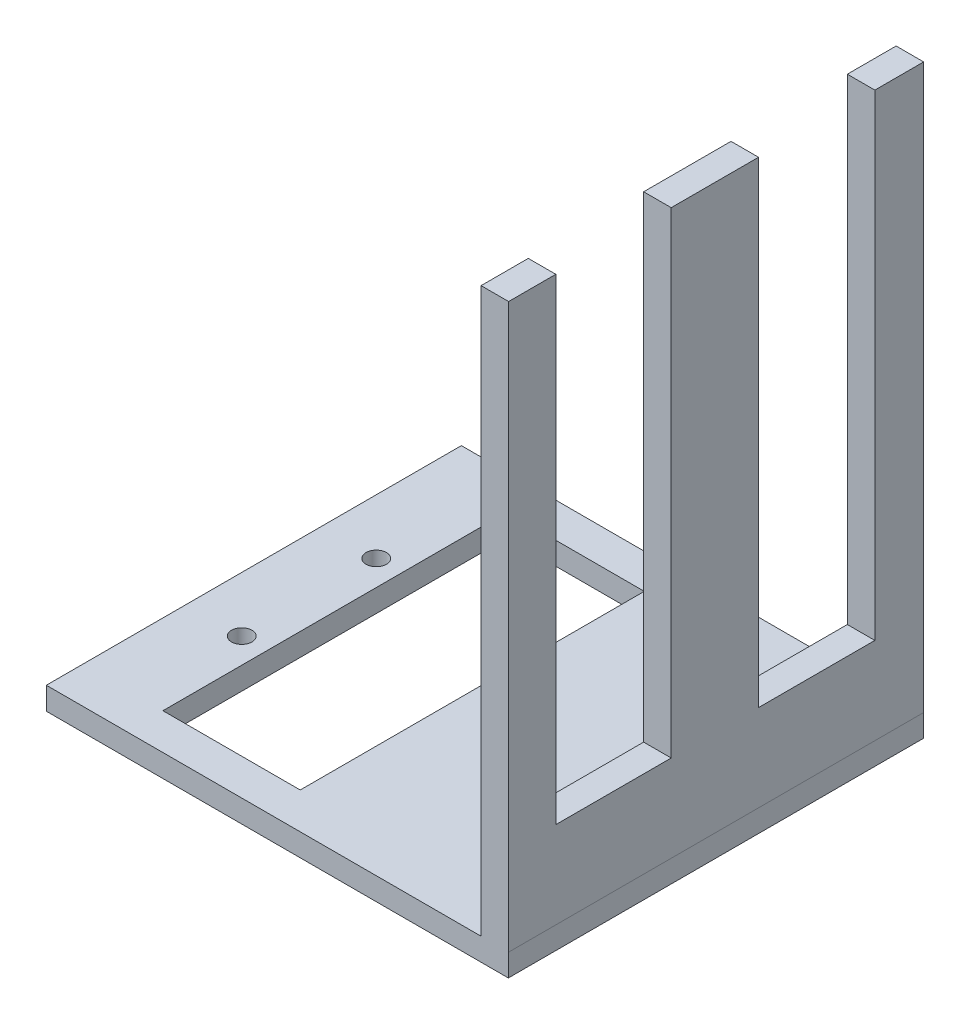
ISO-10303-21;
HEADER;
FILE_DESCRIPTION(('STEP AP214'),'2;1');
FILE_NAME('part.step','',(''),(''),'','','');
FILE_SCHEMA(('AUTOMOTIVE_DESIGN { 1 0 10303 214 1 1 1 1 }'));
ENDSEC;
DATA;
#1=APPLICATION_CONTEXT('core data for automotive mechanical design processes');
#2=APPLICATION_PROTOCOL_DEFINITION('international standard','automotive_design',2000,#1);
#3=PRODUCT_CONTEXT('',#1,'mechanical');
#4=PRODUCT('Part','Part','',(#3));
#5=PRODUCT_RELATED_PRODUCT_CATEGORY('part','',(#4));
#6=PRODUCT_DEFINITION_FORMATION('','',#4);
#7=PRODUCT_DEFINITION_CONTEXT('part definition',#1,'design');
#8=PRODUCT_DEFINITION('design','',#6,#7);
#9=PRODUCT_DEFINITION_SHAPE('','',#8);
#10=(LENGTH_UNIT() NAMED_UNIT(*) SI_UNIT(.MILLI.,.METRE.));
#11=(NAMED_UNIT(*) PLANE_ANGLE_UNIT() SI_UNIT($,.RADIAN.));
#12=(NAMED_UNIT(*) SI_UNIT($,.STERADIAN.) SOLID_ANGLE_UNIT());
#13=UNCERTAINTY_MEASURE_WITH_UNIT(LENGTH_MEASURE(1.E-05),#10,'distance_accuracy_value','');
#14=(GEOMETRIC_REPRESENTATION_CONTEXT(3) GLOBAL_UNCERTAINTY_ASSIGNED_CONTEXT((#13)) GLOBAL_UNIT_ASSIGNED_CONTEXT((#10,
#11,#12)) REPRESENTATION_CONTEXT('',''));
#15=CARTESIAN_POINT('',(0.,0.,0.));
#16=DIRECTION('',(0.,0.,1.));
#17=DIRECTION('',(1.,0.,0.));
#18=AXIS2_PLACEMENT_3D('',#15,#16,#17);
#19=CARTESIAN_POINT('',(0.,104.,0.));
#20=DIRECTION('',(0.,1.,0.));
#21=DIRECTION('',(0.,0.,1.));
#22=AXIS2_PLACEMENT_3D('',#19,#20,#21);
#23=PLANE('',#22);
#24=DIRECTION('',(-1.,0.,0.));
#25=VECTOR('',#24,1.);
#26=CARTESIAN_POINT('',(0.,104.,10.1357515163727));
#27=LINE('',#26,#25);
#28=CARTESIAN_POINT('',(41.7155006134067,104.,10.1357515163727));
#29=VERTEX_POINT('',#28);
#30=CARTESIAN_POINT('',(36.8283216627106,104.,10.1357515163727));
#31=VERTEX_POINT('',#30);
#32=EDGE_CURVE('E11',#29,#31,#27,.T.);
#33=ORIENTED_EDGE('',*,*,#32,.F.);
#34=DIRECTION('',(0.,0.,-1.));
#35=VECTOR('',#34,1.);
#36=CARTESIAN_POINT('',(41.7155006134067,104.,-34.672058238389));
#37=LINE('',#36,#35);
#38=CARTESIAN_POINT('',(41.7155006134067,104.,-5.36606988117683));
#39=VERTEX_POINT('',#38);
#40=EDGE_CURVE('E259',#29,#39,#37,.T.);
#41=ORIENTED_EDGE('',*,*,#40,.T.);
#42=DIRECTION('',(1.,0.,0.));
#43=VECTOR('',#42,1.);
#44=CARTESIAN_POINT('',(0.,104.,-5.36606988117683));
#45=LINE('',#44,#43);
#46=CARTESIAN_POINT('',(36.8283216627106,104.,-5.36606988117683));
#47=VERTEX_POINT('',#46);
#48=EDGE_CURVE('E330',#47,#39,#45,.T.);
#49=ORIENTED_EDGE('',*,*,#48,.F.);
#50=DIRECTION('',(0.,0.,1.));
#51=VECTOR('',#50,1.);
#52=CARTESIAN_POINT('',(36.8283216627106,104.,-34.672058238389));
#53=LINE('',#52,#51);
#54=EDGE_CURVE('E252',#47,#31,#53,.T.);
#55=ORIENTED_EDGE('',*,*,#54,.T.);
#56=EDGE_LOOP('',(#33,#41,#49,#55));
#57=FACE_BOUND('',#56,.T.);
#58=ADVANCED_FACE('F33',(#57),#23,.T.);
#59=DIRECTION('',(-1.,0.,0.));
#60=VECTOR('',#59,1.);
#61=CARTESIAN_POINT('',(0.,104.,-26.0087154571806));
#62=LINE('',#61,#60);
#63=CARTESIAN_POINT('',(41.7155006134067,104.,-26.0087154571806));
#64=VERTEX_POINT('',#63);
#65=CARTESIAN_POINT('',(36.8283216627106,104.,-26.0087154571806));
#66=VERTEX_POINT('',#65);
#67=EDGE_CURVE('E332',#64,#66,#62,.T.);
#68=ORIENTED_EDGE('',*,*,#67,.F.);
#69=CARTESIAN_POINT('',(41.7155006134067,104.,-34.672058238389));
#70=VERTEX_POINT('',#69);
#71=EDGE_CURVE('E255',#64,#70,#37,.T.);
#72=ORIENTED_EDGE('',*,*,#71,.T.);
#73=DIRECTION('',(-1.,0.,0.));
#74=VECTOR('',#73,1.);
#75=CARTESIAN_POINT('',(36.8283216627106,104.,-34.672058238389));
#76=LINE('',#75,#74);
#77=CARTESIAN_POINT('',(36.8283216627106,104.,-34.672058238389));
#78=VERTEX_POINT('',#77);
#79=EDGE_CURVE('E258',#70,#78,#76,.T.);
#80=ORIENTED_EDGE('',*,*,#79,.T.);
#81=EDGE_CURVE('E248',#78,#66,#53,.T.);
#82=ORIENTED_EDGE('',*,*,#81,.T.);
#83=EDGE_LOOP('',(#68,#72,#80,#82));
#84=FACE_BOUND('',#83,.T.);
#85=ADVANCED_FACE('F343',(#84),#23,.T.);
#86=CARTESIAN_POINT('',(-40.3323535464941,4.,-34.672058238389));
#87=DIRECTION('',(1.,0.,0.));
#88=DIRECTION('',(0.,0.,-1.));
#89=AXIS2_PLACEMENT_3D('',#86,#87,#88);
#90=PLANE('',#89);
#91=DIRECTION('',(0.,0.,1.));
#92=VECTOR('',#91,1.);
#93=CARTESIAN_POINT('',(-40.3323535464941,0.,-34.672058238389));
#94=LINE('',#93,#92);
#95=CARTESIAN_POINT('',(-40.3323535464941,0.,-34.672058238389));
#96=VERTEX_POINT('',#95);
#97=CARTESIAN_POINT('',(-40.3323535464941,0.,38.987941761611));
#98=VERTEX_POINT('',#97);
#99=EDGE_CURVE('E283',#96,#98,#94,.T.);
#100=ORIENTED_EDGE('',*,*,#99,.T.);
#101=DIRECTION('',(0.,-1.,0.));
#102=VECTOR('',#101,1.);
#103=CARTESIAN_POINT('',(-40.3323535464941,4.,38.987941761611));
#104=LINE('',#103,#102);
#105=CARTESIAN_POINT('',(-40.3323535464941,4.,38.987941761611));
#106=VERTEX_POINT('',#105);
#107=EDGE_CURVE('E311',#106,#98,#104,.T.);
#108=ORIENTED_EDGE('',*,*,#107,.F.);
#109=DIRECTION('',(0.,0.,1.));
#110=VECTOR('',#109,1.);
#111=CARTESIAN_POINT('',(-40.3323535464941,4.,-34.672058238389));
#112=LINE('',#111,#110);
#113=CARTESIAN_POINT('',(-40.3323535464941,4.,-34.672058238389));
#114=VERTEX_POINT('',#113);
#115=EDGE_CURVE('E284',#114,#106,#112,.T.);
#116=ORIENTED_EDGE('',*,*,#115,.F.);
#117=DIRECTION('',(0.,-1.,0.));
#118=VECTOR('',#117,1.);
#119=CARTESIAN_POINT('',(-40.3323535464941,4.,-34.672058238389));
#120=LINE('',#119,#118);
#121=EDGE_CURVE('E295',#114,#96,#120,.T.);
#122=ORIENTED_EDGE('',*,*,#121,.T.);
#123=EDGE_LOOP('',(#100,#108,#116,#122));
#124=FACE_BOUND('',#123,.T.);
#125=ADVANCED_FACE('F35',(#124),#90,.F.);
#126=CARTESIAN_POINT('',(-40.3323535464941,4.,38.987941761611));
#127=DIRECTION('',(0.,0.,-1.));
#128=DIRECTION('',(-1.,0.,0.));
#129=AXIS2_PLACEMENT_3D('',#126,#127,#128);
#130=PLANE('',#129);
#131=DIRECTION('',(1.,0.,0.));
#132=VECTOR('',#131,1.);
#133=CARTESIAN_POINT('',(-40.3323535464941,0.,38.987941761611));
#134=LINE('',#133,#132);
#135=CARTESIAN_POINT('',(41.6676464535059,0.,38.987941761611));
#136=VERTEX_POINT('',#135);
#137=EDGE_CURVE('E298',#98,#136,#134,.T.);
#138=ORIENTED_EDGE('',*,*,#137,.T.);
#139=DIRECTION('',(0.,-1.,0.));
#140=VECTOR('',#139,1.);
#141=CARTESIAN_POINT('',(41.6676464535059,4.,38.987941761611));
#142=LINE('',#141,#140);
#143=CARTESIAN_POINT('',(41.6676464535059,4.,38.987941761611));
#144=VERTEX_POINT('',#143);
#145=EDGE_CURVE('E308',#144,#136,#142,.T.);
#146=ORIENTED_EDGE('',*,*,#145,.F.);
#147=DIRECTION('',(1.,0.,0.));
#148=VECTOR('',#147,1.);
#149=CARTESIAN_POINT('',(36.8283216627106,4.,38.987941761611));
#150=LINE('',#149,#148);
#151=CARTESIAN_POINT('',(41.7155006134067,4.,38.987941761611));
#152=VERTEX_POINT('',#151);
#153=EDGE_CURVE('E265',#144,#152,#150,.T.);
#154=ORIENTED_EDGE('',*,*,#153,.T.);
#155=DIRECTION('',(0.,-1.,0.));
#156=VECTOR('',#155,1.);
#157=CARTESIAN_POINT('',(41.7155006134067,104.,38.987941761611));
#158=LINE('',#157,#156);
#159=CARTESIAN_POINT('',(41.7155006134067,104.,38.987941761611));
#160=VERTEX_POINT('',#159);
#161=EDGE_CURVE('E277',#160,#152,#158,.T.);
#162=ORIENTED_EDGE('',*,*,#161,.F.);
#163=DIRECTION('',(1.,0.,0.));
#164=VECTOR('',#163,1.);
#165=CARTESIAN_POINT('',(36.8283216627106,104.,38.987941761611));
#166=LINE('',#165,#164);
#167=CARTESIAN_POINT('',(36.8283216627106,104.,38.987941761611));
#168=VERTEX_POINT('',#167);
#169=EDGE_CURVE('E251',#168,#160,#166,.T.);
#170=ORIENTED_EDGE('',*,*,#169,.F.);
#171=DIRECTION('',(0.,-1.,0.));
#172=VECTOR('',#171,1.);
#173=CARTESIAN_POINT('',(36.8283216627106,104.,38.987941761611));
#174=LINE('',#173,#172);
#175=CARTESIAN_POINT('',(36.8283216627106,4.,38.987941761611));
#176=VERTEX_POINT('',#175);
#177=EDGE_CURVE('E280',#168,#176,#174,.T.);
#178=ORIENTED_EDGE('',*,*,#177,.T.);
#179=DIRECTION('',(1.,0.,0.));
#180=VECTOR('',#179,1.);
#181=CARTESIAN_POINT('',(-40.3323535464941,4.,38.987941761611));
#182=LINE('',#181,#180);
#183=EDGE_CURVE('E287',#106,#176,#182,.T.);
#184=ORIENTED_EDGE('',*,*,#183,.F.);
#185=ORIENTED_EDGE('',*,*,#107,.T.);
#186=EDGE_LOOP('',(#138,#146,#154,#162,#170,#178,#184,#185));
#187=FACE_BOUND('',#186,.T.);
#188=ADVANCED_FACE('F359',(#187),#130,.F.);
#189=CARTESIAN_POINT('',(41.6676464535059,4.,-34.672058238389));
#190=DIRECTION('',(-1.,0.,0.));
#191=DIRECTION('',(0.,0.,1.));
#192=AXIS2_PLACEMENT_3D('',#189,#190,#191);
#193=PLANE('',#192);
#194=DIRECTION('',(0.,0.,-1.));
#195=VECTOR('',#194,1.);
#196=CARTESIAN_POINT('',(41.6676464535059,0.,-34.672058238389));
#197=LINE('',#196,#195);
#198=CARTESIAN_POINT('',(41.6676464535059,0.,-34.672058238389));
#199=VERTEX_POINT('',#198);
#200=EDGE_CURVE('E300',#136,#199,#197,.T.);
#201=ORIENTED_EDGE('',*,*,#200,.T.);
#202=DIRECTION('',(0.,-1.,0.));
#203=VECTOR('',#202,1.);
#204=CARTESIAN_POINT('',(41.6676464535059,4.,-34.672058238389));
#205=LINE('',#204,#203);
#206=CARTESIAN_POINT('',(41.6676464535059,4.,-34.672058238389));
#207=VERTEX_POINT('',#206);
#208=EDGE_CURVE('E305',#207,#199,#205,.T.);
#209=ORIENTED_EDGE('',*,*,#208,.F.);
#210=DIRECTION('',(0.,0.,-1.));
#211=VECTOR('',#210,1.);
#212=CARTESIAN_POINT('',(41.6676464535059,4.,-34.672058238389));
#213=LINE('',#212,#211);
#214=EDGE_CURVE('E290',#144,#207,#213,.T.);
#215=ORIENTED_EDGE('',*,*,#214,.F.);
#216=ORIENTED_EDGE('',*,*,#145,.T.);
#217=EDGE_LOOP('',(#201,#209,#215,#216));
#218=FACE_BOUND('',#217,.T.);
#219=ADVANCED_FACE('F410',(#218),#193,.F.);
#220=CARTESIAN_POINT('',(-40.3323535464941,4.,-34.672058238389));
#221=DIRECTION('',(0.,0.,1.));
#222=DIRECTION('',(1.,0.,0.));
#223=AXIS2_PLACEMENT_3D('',#220,#221,#222);
#224=PLANE('',#223);
#225=DIRECTION('',(-1.,0.,0.));
#226=VECTOR('',#225,1.);
#227=CARTESIAN_POINT('',(-40.3323535464941,0.,-34.672058238389));
#228=LINE('',#227,#226);
#229=EDGE_CURVE('E288',#199,#96,#228,.T.);
#230=ORIENTED_EDGE('',*,*,#229,.T.);
#231=ORIENTED_EDGE('',*,*,#121,.F.);
#232=DIRECTION('',(-1.,0.,0.));
#233=VECTOR('',#232,1.);
#234=CARTESIAN_POINT('',(-40.3323535464941,4.,-34.672058238389));
#235=LINE('',#234,#233);
#236=CARTESIAN_POINT('',(36.8283216627106,4.,-34.672058238389));
#237=VERTEX_POINT('',#236);
#238=EDGE_CURVE('E293',#237,#114,#235,.T.);
#239=ORIENTED_EDGE('',*,*,#238,.F.);
#240=DIRECTION('',(0.,-1.,0.));
#241=VECTOR('',#240,1.);
#242=CARTESIAN_POINT('',(36.8283216627106,104.,-34.672058238389));
#243=LINE('',#242,#241);
#244=EDGE_CURVE('E261',#78,#237,#243,.T.);
#245=ORIENTED_EDGE('',*,*,#244,.F.);
#246=ORIENTED_EDGE('',*,*,#79,.F.);
#247=DIRECTION('',(0.,-1.,0.));
#248=VECTOR('',#247,1.);
#249=CARTESIAN_POINT('',(41.7155006134067,104.,-34.672058238389));
#250=LINE('',#249,#248);
#251=CARTESIAN_POINT('',(41.7155006134067,4.,-34.672058238389));
#252=VERTEX_POINT('',#251);
#253=EDGE_CURVE('E274',#70,#252,#250,.T.);
#254=ORIENTED_EDGE('',*,*,#253,.T.);
#255=DIRECTION('',(-1.,0.,0.));
#256=VECTOR('',#255,1.);
#257=CARTESIAN_POINT('',(36.8283216627106,4.,-34.672058238389));
#258=LINE('',#257,#256);
#259=EDGE_CURVE('E269',#252,#207,#258,.T.);
#260=ORIENTED_EDGE('',*,*,#259,.T.);
#261=ORIENTED_EDGE('',*,*,#208,.T.);
#262=EDGE_LOOP('',(#230,#231,#239,#245,#246,#254,#260,#261));
#263=FACE_BOUND('',#262,.T.);
#264=ADVANCED_FACE('F349',(#263),#224,.F.);
#265=CARTESIAN_POINT('',(0.,4.,0.));
#266=DIRECTION('',(0.,1.,0.));
#267=DIRECTION('',(0.,0.,1.));
#268=AXIS2_PLACEMENT_3D('',#265,#266,#267);
#269=PLANE('',#268);
#270=DIRECTION('',(0.,0.,-1.));
#271=VECTOR('',#270,1.);
#272=CARTESIAN_POINT('',(-1.70011262750802,4.,-28.5027211675137));
#273=LINE('',#272,#271);
#274=CARTESIAN_POINT('',(-1.70011262750802,4.,32.5599938993808));
#275=VERTEX_POINT('',#274);
#276=CARTESIAN_POINT('',(-1.70011262750802,4.,-28.5027211675137));
#277=VERTEX_POINT('',#276);
#278=EDGE_CURVE('E220',#275,#277,#273,.T.);
#279=ORIENTED_EDGE('',*,*,#278,.F.);
#280=DIRECTION('',(1.,0.,0.));
#281=VECTOR('',#280,1.);
#282=CARTESIAN_POINT('',(-1.70011262750802,4.,32.5599938993808));
#283=LINE('',#282,#281);
#284=CARTESIAN_POINT('',(-26.070112627508,4.,32.5599938993808));
#285=VERTEX_POINT('',#284);
#286=EDGE_CURVE('E228',#285,#275,#283,.T.);
#287=ORIENTED_EDGE('',*,*,#286,.F.);
#288=DIRECTION('',(0.,0.,1.));
#289=VECTOR('',#288,1.);
#290=CARTESIAN_POINT('',(-26.070112627508,4.,-28.5027211675137));
#291=LINE('',#290,#289);
#292=CARTESIAN_POINT('',(-26.070112627508,4.,-28.5027211675137));
#293=VERTEX_POINT('',#292);
#294=EDGE_CURVE('E225',#293,#285,#291,.T.);
#295=ORIENTED_EDGE('',*,*,#294,.F.);
#296=DIRECTION('',(-1.,0.,0.));
#297=VECTOR('',#296,1.);
#298=CARTESIAN_POINT('',(-1.70011262750802,4.,-28.5027211675137));
#299=LINE('',#298,#297);
#300=EDGE_CURVE('E222',#277,#293,#299,.T.);
#301=ORIENTED_EDGE('',*,*,#300,.F.);
#302=EDGE_LOOP('',(#279,#287,#295,#301));
#303=FACE_BOUND('',#302,.T.);
#304=CARTESIAN_POINT('',(-30.5440501475938,4.,14.097941761611));
#305=DIRECTION('',(0.,1.,0.));
#306=DIRECTION('',(0.,0.,1.));
#307=AXIS2_PLACEMENT_3D('',#304,#305,#306);
#308=CIRCLE('',#307,1.8125);
#309=CARTESIAN_POINT('',(-30.5440501475938,4.,15.910441761611));
#310=VERTEX_POINT('',#309);
#311=EDGE_CURVE('E234',#310,#310,#308,.T.);
#312=ORIENTED_EDGE('',*,*,#311,.F.);
#313=EDGE_LOOP('',(#312));
#314=FACE_BOUND('',#313,.T.);
#315=CARTESIAN_POINT('',(-30.5440501475938,4.,-9.782058238389));
#316=DIRECTION('',(0.,1.,0.));
#317=DIRECTION('',(0.,0.,1.));
#318=AXIS2_PLACEMENT_3D('',#315,#316,#317);
#319=CIRCLE('',#318,1.8125);
#320=CARTESIAN_POINT('',(-30.5440501475938,4.,-7.969558238389));
#321=VERTEX_POINT('',#320);
#322=EDGE_CURVE('E244',#321,#321,#319,.T.);
#323=ORIENTED_EDGE('',*,*,#322,.F.);
#324=EDGE_LOOP('',(#323));
#325=FACE_BOUND('',#324,.T.);
#326=DIRECTION('',(0.,0.,1.));
#327=VECTOR('',#326,1.);
#328=CARTESIAN_POINT('',(36.8283216627106,4.,-34.672058238389));
#329=LINE('',#328,#327);
#330=EDGE_CURVE('E262',#237,#176,#329,.T.);
#331=ORIENTED_EDGE('',*,*,#330,.F.);
#332=ORIENTED_EDGE('',*,*,#238,.T.);
#333=ORIENTED_EDGE('',*,*,#115,.T.);
#334=ORIENTED_EDGE('',*,*,#183,.T.);
#335=EDGE_LOOP('',(#331,#332,#333,#334));
#336=FACE_BOUND('',#335,.T.);
#337=ADVANCED_FACE('F354',(#303,#314,#325,#336),#269,.T.);
#338=CARTESIAN_POINT('',(0.,0.,0.));
#339=DIRECTION('',(0.,1.,0.));
#340=DIRECTION('',(0.,0.,1.));
#341=AXIS2_PLACEMENT_3D('',#338,#339,#340);
#342=PLANE('',#341);
#343=DIRECTION('',(1.,0.,0.));
#344=VECTOR('',#343,1.);
#345=CARTESIAN_POINT('',(0.,0.,32.5599938993808));
#346=LINE('',#345,#344);
#347=CARTESIAN_POINT('',(-26.070112627508,0.,32.5599938993808));
#348=VERTEX_POINT('',#347);
#349=CARTESIAN_POINT('',(-1.70011262750802,0.,32.5599938993808));
#350=VERTEX_POINT('',#349);
#351=EDGE_CURVE('E324',#348,#350,#346,.T.);
#352=ORIENTED_EDGE('',*,*,#351,.T.);
#353=DIRECTION('',(0.,0.,-1.));
#354=VECTOR('',#353,1.);
#355=CARTESIAN_POINT('',(-1.70011262750802,0.,0.));
#356=LINE('',#355,#354);
#357=CARTESIAN_POINT('',(-1.70011262750802,0.,-28.5027211675137));
#358=VERTEX_POINT('',#357);
#359=EDGE_CURVE('E327',#350,#358,#356,.T.);
#360=ORIENTED_EDGE('',*,*,#359,.T.);
#361=DIRECTION('',(-1.,0.,0.));
#362=VECTOR('',#361,1.);
#363=CARTESIAN_POINT('',(0.,0.,-28.5027211675137));
#364=LINE('',#363,#362);
#365=CARTESIAN_POINT('',(-26.070112627508,0.,-28.5027211675137));
#366=VERTEX_POINT('',#365);
#367=EDGE_CURVE('E314',#358,#366,#364,.T.);
#368=ORIENTED_EDGE('',*,*,#367,.T.);
#369=DIRECTION('',(0.,0.,1.));
#370=VECTOR('',#369,1.);
#371=CARTESIAN_POINT('',(-26.070112627508,0.,0.));
#372=LINE('',#371,#370);
#373=EDGE_CURVE('E321',#366,#348,#372,.T.);
#374=ORIENTED_EDGE('',*,*,#373,.T.);
#375=EDGE_LOOP('',(#352,#360,#368,#374));
#376=FACE_BOUND('',#375,.T.);
#377=CARTESIAN_POINT('',(-30.5440501475938,0.,14.097941761611));
#378=DIRECTION('',(0.,1.,0.));
#379=DIRECTION('',(0.,0.,1.));
#380=AXIS2_PLACEMENT_3D('',#377,#378,#379);
#381=CIRCLE('',#380,1.8125);
#382=CARTESIAN_POINT('',(-30.5440501475938,0.,15.910441761611));
#383=VERTEX_POINT('',#382);
#384=EDGE_CURVE('E243',#383,#383,#381,.T.);
#385=ORIENTED_EDGE('',*,*,#384,.T.);
#386=EDGE_LOOP('',(#385));
#387=FACE_BOUND('',#386,.T.);
#388=CARTESIAN_POINT('',(-30.5440501475938,0.,-9.782058238389));
#389=DIRECTION('',(0.,1.,0.));
#390=DIRECTION('',(0.,0.,1.));
#391=AXIS2_PLACEMENT_3D('',#388,#389,#390);
#392=CIRCLE('',#391,1.8125);
#393=CARTESIAN_POINT('',(-30.5440501475938,0.,-7.969558238389));
#394=VERTEX_POINT('',#393);
#395=EDGE_CURVE('E247',#394,#394,#392,.T.);
#396=ORIENTED_EDGE('',*,*,#395,.T.);
#397=EDGE_LOOP('',(#396));
#398=FACE_BOUND('',#397,.T.);
#399=ORIENTED_EDGE('',*,*,#99,.F.);
#400=ORIENTED_EDGE('',*,*,#229,.F.);
#401=ORIENTED_EDGE('',*,*,#200,.F.);
#402=ORIENTED_EDGE('',*,*,#137,.F.);
#403=EDGE_LOOP('',(#399,#400,#401,#402));
#404=FACE_BOUND('',#403,.T.);
#405=ADVANCED_FACE('F403',(#376,#387,#398,#404),#342,.F.);
#406=CARTESIAN_POINT('',(0.,4.,0.));
#407=DIRECTION('',(0.,1.,0.));
#408=DIRECTION('',(0.,0.,1.));
#409=AXIS2_PLACEMENT_3D('',#406,#407,#408);
#410=PLANE('',#409);
#411=ORIENTED_EDGE('',*,*,#153,.F.);
#412=ORIENTED_EDGE('',*,*,#214,.T.);
#413=ORIENTED_EDGE('',*,*,#259,.F.);
#414=DIRECTION('',(0.,0.,-1.));
#415=VECTOR('',#414,1.);
#416=CARTESIAN_POINT('',(41.7155006134067,4.,-34.672058238389));
#417=LINE('',#416,#415);
#418=EDGE_CURVE('E267',#152,#252,#417,.T.);
#419=ORIENTED_EDGE('',*,*,#418,.F.);
#420=EDGE_LOOP('',(#411,#412,#413,#419));
#421=FACE_BOUND('',#420,.T.);
#422=ADVANCED_FACE('F398',(#421),#410,.F.);
#423=CARTESIAN_POINT('',(36.8283216627106,104.,-34.672058238389));
#424=DIRECTION('',(1.,0.,0.));
#425=DIRECTION('',(0.,0.,-1.));
#426=AXIS2_PLACEMENT_3D('',#423,#424,#425);
#427=PLANE('',#426);
#428=DIRECTION('',(0.,0.,-1.));
#429=VECTOR('',#428,1.);
#430=CARTESIAN_POINT('',(36.8283216627106,19.4116628171059,-34.672058238389));
#431=LINE('',#430,#429);
#432=CARTESIAN_POINT('',(36.8283216627106,19.4116628171059,30.6149391770418));
#433=VERTEX_POINT('',#432);
#434=CARTESIAN_POINT('',(36.8283216627106,19.4116628171059,10.1357515163727));
#435=VERTEX_POINT('',#434);
#436=EDGE_CURVE('E179',#433,#435,#431,.T.);
#437=ORIENTED_EDGE('',*,*,#436,.T.);
#438=DIRECTION('',(0.,1.,0.));
#439=VECTOR('',#438,1.);
#440=CARTESIAN_POINT('',(36.8283216627106,104.,10.1357515163727));
#441=LINE('',#440,#439);
#442=EDGE_CURVE('E197',#435,#31,#441,.T.);
#443=ORIENTED_EDGE('',*,*,#442,.T.);
#444=ORIENTED_EDGE('',*,*,#54,.F.);
#445=DIRECTION('',(0.,-1.,0.));
#446=VECTOR('',#445,1.);
#447=CARTESIAN_POINT('',(36.8283216627106,104.,-5.36606988117683));
#448=LINE('',#447,#446);
#449=CARTESIAN_POINT('',(36.8283216627106,19.4116628171059,-5.36606988117683));
#450=VERTEX_POINT('',#449);
#451=EDGE_CURVE('E56',#47,#450,#448,.T.);
#452=ORIENTED_EDGE('',*,*,#451,.T.);
#453=DIRECTION('',(0.,0.,-1.));
#454=VECTOR('',#453,1.);
#455=CARTESIAN_POINT('',(36.8283216627106,19.4116628171059,-34.672058238389));
#456=LINE('',#455,#454);
#457=CARTESIAN_POINT('',(36.8283216627106,19.4116628171059,-26.0087154571806));
#458=VERTEX_POINT('',#457);
#459=EDGE_CURVE('E217',#450,#458,#456,.T.);
#460=ORIENTED_EDGE('',*,*,#459,.T.);
#461=DIRECTION('',(0.,1.,0.));
#462=VECTOR('',#461,1.);
#463=CARTESIAN_POINT('',(36.8283216627106,104.,-26.0087154571806));
#464=LINE('',#463,#462);
#465=EDGE_CURVE('E214',#458,#66,#464,.T.);
#466=ORIENTED_EDGE('',*,*,#465,.T.);
#467=ORIENTED_EDGE('',*,*,#81,.F.);
#468=ORIENTED_EDGE('',*,*,#244,.T.);
#469=ORIENTED_EDGE('',*,*,#330,.T.);
#470=ORIENTED_EDGE('',*,*,#177,.F.);
#471=CARTESIAN_POINT('',(36.8283216627106,104.,30.6149391770418));
#472=VERTEX_POINT('',#471);
#473=EDGE_CURVE('E253',#472,#168,#53,.T.);
#474=ORIENTED_EDGE('',*,*,#473,.F.);
#475=DIRECTION('',(0.,-1.,0.));
#476=VECTOR('',#475,1.);
#477=CARTESIAN_POINT('',(36.8283216627106,104.,30.6149391770418));
#478=LINE('',#477,#476);
#479=EDGE_CURVE('E48',#472,#433,#478,.T.);
#480=ORIENTED_EDGE('',*,*,#479,.T.);
#481=EDGE_LOOP('',(#437,#443,#444,#452,#460,#466,#467,#468,#469,#470,#474,#480));
#482=FACE_BOUND('',#481,.T.);
#483=ADVANCED_FACE('F342',(#482),#427,.F.);
#484=CARTESIAN_POINT('',(41.7155006134067,104.,-34.672058238389));
#485=DIRECTION('',(-1.,0.,0.));
#486=DIRECTION('',(0.,0.,1.));
#487=AXIS2_PLACEMENT_3D('',#484,#485,#486);
#488=PLANE('',#487);
#489=ORIENTED_EDGE('',*,*,#40,.F.);
#490=DIRECTION('',(0.,1.,0.));
#491=VECTOR('',#490,1.);
#492=CARTESIAN_POINT('',(41.7155006134067,19.4116628171059,10.1357515163727));
#493=LINE('',#492,#491);
#494=CARTESIAN_POINT('',(41.7155006134067,19.4116628171059,10.1357515163727));
#495=VERTEX_POINT('',#494);
#496=EDGE_CURVE('E188',#495,#29,#493,.T.);
#497=ORIENTED_EDGE('',*,*,#496,.F.);
#498=DIRECTION('',(0.,0.,-1.));
#499=VECTOR('',#498,1.);
#500=CARTESIAN_POINT('',(41.7155006134067,19.4116628171059,10.1357515163727));
#501=LINE('',#500,#499);
#502=CARTESIAN_POINT('',(41.7155006134067,19.4116628171059,30.6149391770418));
#503=VERTEX_POINT('',#502);
#504=EDGE_CURVE('E176',#503,#495,#501,.T.);
#505=ORIENTED_EDGE('',*,*,#504,.F.);
#506=DIRECTION('',(0.,-1.,0.));
#507=VECTOR('',#506,1.);
#508=CARTESIAN_POINT('',(41.7155006134067,19.4116628171059,30.6149391770418));
#509=LINE('',#508,#507);
#510=CARTESIAN_POINT('',(41.7155006134067,104.,30.6149391770418));
#511=VERTEX_POINT('',#510);
#512=EDGE_CURVE('E183',#511,#503,#509,.T.);
#513=ORIENTED_EDGE('',*,*,#512,.F.);
#514=EDGE_CURVE('E256',#160,#511,#37,.T.);
#515=ORIENTED_EDGE('',*,*,#514,.F.);
#516=ORIENTED_EDGE('',*,*,#161,.T.);
#517=ORIENTED_EDGE('',*,*,#418,.T.);
#518=ORIENTED_EDGE('',*,*,#253,.F.);
#519=ORIENTED_EDGE('',*,*,#71,.F.);
#520=DIRECTION('',(0.,1.,0.));
#521=VECTOR('',#520,1.);
#522=CARTESIAN_POINT('',(41.7155006134067,19.4116628171059,-26.0087154571806));
#523=LINE('',#522,#521);
#524=CARTESIAN_POINT('',(41.7155006134067,19.4116628171059,-26.0087154571806));
#525=VERTEX_POINT('',#524);
#526=EDGE_CURVE('E201',#525,#64,#523,.T.);
#527=ORIENTED_EDGE('',*,*,#526,.F.);
#528=DIRECTION('',(0.,0.,-1.));
#529=VECTOR('',#528,1.);
#530=CARTESIAN_POINT('',(41.7155006134067,19.4116628171059,-26.0087154571806));
#531=LINE('',#530,#529);
#532=CARTESIAN_POINT('',(41.7155006134067,19.4116628171059,-5.36606988117683));
#533=VERTEX_POINT('',#532);
#534=EDGE_CURVE('E206',#533,#525,#531,.T.);
#535=ORIENTED_EDGE('',*,*,#534,.F.);
#536=DIRECTION('',(0.,-1.,0.));
#537=VECTOR('',#536,1.);
#538=CARTESIAN_POINT('',(41.7155006134067,19.4116628171059,-5.36606988117683));
#539=LINE('',#538,#537);
#540=EDGE_CURVE('E203',#39,#533,#539,.T.);
#541=ORIENTED_EDGE('',*,*,#540,.F.);
#542=EDGE_LOOP('',(#489,#497,#505,#513,#515,#516,#517,#518,#519,#527,#535,#541));
#543=FACE_BOUND('',#542,.T.);
#544=ADVANCED_FACE('F191',(#543),#488,.F.);
#545=DIRECTION('',(1.,0.,0.));
#546=VECTOR('',#545,1.);
#547=CARTESIAN_POINT('',(0.,104.,30.6149391770418));
#548=LINE('',#547,#546);
#549=EDGE_CURVE('E41',#472,#511,#548,.T.);
#550=ORIENTED_EDGE('',*,*,#549,.F.);
#551=ORIENTED_EDGE('',*,*,#473,.T.);
#552=ORIENTED_EDGE('',*,*,#169,.T.);
#553=ORIENTED_EDGE('',*,*,#514,.T.);
#554=EDGE_LOOP('',(#550,#551,#552,#553));
#555=FACE_BOUND('',#554,.T.);
#556=ADVANCED_FACE('F362',(#555),#23,.T.);
#557=CARTESIAN_POINT('',(-30.5440501475938,-6.,-9.782058238389));
#558=DIRECTION('',(0.,1.,0.));
#559=DIRECTION('',(0.,0.,1.));
#560=AXIS2_PLACEMENT_3D('',#557,#558,#559);
#561=CYLINDRICAL_SURFACE('',#560,1.8125);
#562=ORIENTED_EDGE('',*,*,#322,.T.);
#563=EDGE_LOOP('',(#562));
#564=FACE_BOUND('',#563,.T.);
#565=ORIENTED_EDGE('',*,*,#395,.F.);
#566=EDGE_LOOP('',(#565));
#567=FACE_BOUND('',#566,.T.);
#568=ADVANCED_FACE('F387',(#564,#567),#561,.F.);
#569=CARTESIAN_POINT('',(-30.5440501475938,-6.,14.097941761611));
#570=DIRECTION('',(0.,1.,0.));
#571=DIRECTION('',(0.,0.,1.));
#572=AXIS2_PLACEMENT_3D('',#569,#570,#571);
#573=CYLINDRICAL_SURFACE('',#572,1.8125);
#574=ORIENTED_EDGE('',*,*,#311,.T.);
#575=EDGE_LOOP('',(#574));
#576=FACE_BOUND('',#575,.T.);
#577=ORIENTED_EDGE('',*,*,#384,.F.);
#578=EDGE_LOOP('',(#577));
#579=FACE_BOUND('',#578,.T.);
#580=ADVANCED_FACE('F392',(#576,#579),#573,.F.);
#581=CARTESIAN_POINT('',(-1.70011262750802,-6.,-28.5027211675137));
#582=DIRECTION('',(1.,0.,0.));
#583=DIRECTION('',(0.,0.,-1.));
#584=AXIS2_PLACEMENT_3D('',#581,#582,#583);
#585=PLANE('',#584);
#586=DIRECTION('',(0.,1.,0.));
#587=VECTOR('',#586,1.);
#588=CARTESIAN_POINT('',(-1.70011262750802,-6.,32.5599938993808));
#589=LINE('',#588,#587);
#590=EDGE_CURVE('E232',#350,#275,#589,.T.);
#591=ORIENTED_EDGE('',*,*,#590,.T.);
#592=ORIENTED_EDGE('',*,*,#278,.T.);
#593=DIRECTION('',(0.,1.,0.));
#594=VECTOR('',#593,1.);
#595=CARTESIAN_POINT('',(-1.70011262750802,-6.,-28.5027211675137));
#596=LINE('',#595,#594);
#597=EDGE_CURVE('E231',#358,#277,#596,.T.);
#598=ORIENTED_EDGE('',*,*,#597,.F.);
#599=ORIENTED_EDGE('',*,*,#359,.F.);
#600=EDGE_LOOP('',(#591,#592,#598,#599));
#601=FACE_BOUND('',#600,.T.);
#602=ADVANCED_FACE('F449',(#601),#585,.F.);
#603=CARTESIAN_POINT('',(-1.70011262750802,-6.,32.5599938993808));
#604=DIRECTION('',(0.,0.,1.));
#605=DIRECTION('',(1.,0.,0.));
#606=AXIS2_PLACEMENT_3D('',#603,#604,#605);
#607=PLANE('',#606);
#608=DIRECTION('',(0.,1.,0.));
#609=VECTOR('',#608,1.);
#610=CARTESIAN_POINT('',(-26.070112627508,-6.,32.5599938993808));
#611=LINE('',#610,#609);
#612=EDGE_CURVE('E235',#348,#285,#611,.T.);
#613=ORIENTED_EDGE('',*,*,#612,.T.);
#614=ORIENTED_EDGE('',*,*,#286,.T.);
#615=ORIENTED_EDGE('',*,*,#590,.F.);
#616=ORIENTED_EDGE('',*,*,#351,.F.);
#617=EDGE_LOOP('',(#613,#614,#615,#616));
#618=FACE_BOUND('',#617,.T.);
#619=ADVANCED_FACE('F446',(#618),#607,.F.);
#620=CARTESIAN_POINT('',(-26.070112627508,-6.,-28.5027211675137));
#621=DIRECTION('',(-1.,0.,0.));
#622=DIRECTION('',(0.,0.,1.));
#623=AXIS2_PLACEMENT_3D('',#620,#621,#622);
#624=PLANE('',#623);
#625=DIRECTION('',(0.,1.,0.));
#626=VECTOR('',#625,1.);
#627=CARTESIAN_POINT('',(-26.070112627508,-6.,-28.5027211675137));
#628=LINE('',#627,#626);
#629=EDGE_CURVE('E237',#366,#293,#628,.T.);
#630=ORIENTED_EDGE('',*,*,#629,.T.);
#631=ORIENTED_EDGE('',*,*,#294,.T.);
#632=ORIENTED_EDGE('',*,*,#612,.F.);
#633=ORIENTED_EDGE('',*,*,#373,.F.);
#634=EDGE_LOOP('',(#630,#631,#632,#633));
#635=FACE_BOUND('',#634,.T.);
#636=ADVANCED_FACE('F440',(#635),#624,.F.);
#637=CARTESIAN_POINT('',(-1.70011262750802,-6.,-28.5027211675137));
#638=DIRECTION('',(0.,0.,-1.));
#639=DIRECTION('',(-1.,0.,0.));
#640=AXIS2_PLACEMENT_3D('',#637,#638,#639);
#641=PLANE('',#640);
#642=ORIENTED_EDGE('',*,*,#597,.T.);
#643=ORIENTED_EDGE('',*,*,#300,.T.);
#644=ORIENTED_EDGE('',*,*,#629,.F.);
#645=ORIENTED_EDGE('',*,*,#367,.F.);
#646=EDGE_LOOP('',(#642,#643,#644,#645));
#647=FACE_BOUND('',#646,.T.);
#648=ADVANCED_FACE('F434',(#647),#641,.F.);
#649=CARTESIAN_POINT('',(31.7155006134067,19.4116628171059,-26.0087154571806));
#650=DIRECTION('',(0.,-1.,0.));
#651=DIRECTION('',(0.,0.,-1.));
#652=AXIS2_PLACEMENT_3D('',#649,#650,#651);
#653=PLANE('',#652);
#654=DIRECTION('',(1.,0.,0.));
#655=VECTOR('',#654,1.);
#656=CARTESIAN_POINT('',(31.7155006134067,19.4116628171059,-5.36606988117683));
#657=LINE('',#656,#655);
#658=EDGE_CURVE('E209',#450,#533,#657,.T.);
#659=ORIENTED_EDGE('',*,*,#658,.T.);
#660=ORIENTED_EDGE('',*,*,#534,.T.);
#661=DIRECTION('',(1.,0.,0.));
#662=VECTOR('',#661,1.);
#663=CARTESIAN_POINT('',(31.7155006134067,19.4116628171059,-26.0087154571806));
#664=LINE('',#663,#662);
#665=EDGE_CURVE('E210',#458,#525,#664,.T.);
#666=ORIENTED_EDGE('',*,*,#665,.F.);
#667=ORIENTED_EDGE('',*,*,#459,.F.);
#668=EDGE_LOOP('',(#659,#660,#666,#667));
#669=FACE_BOUND('',#668,.T.);
#670=ADVANCED_FACE('F432',(#669),#653,.F.);
#671=CARTESIAN_POINT('',(31.7155006134067,19.4116628171059,-26.0087154571806));
#672=DIRECTION('',(0.,0.,-1.));
#673=DIRECTION('',(-1.,0.,0.));
#674=AXIS2_PLACEMENT_3D('',#671,#672,#673);
#675=PLANE('',#674);
#676=ORIENTED_EDGE('',*,*,#665,.T.);
#677=ORIENTED_EDGE('',*,*,#526,.T.);
#678=ORIENTED_EDGE('',*,*,#67,.T.);
#679=ORIENTED_EDGE('',*,*,#465,.F.);
#680=EDGE_LOOP('',(#676,#677,#678,#679));
#681=FACE_BOUND('',#680,.T.);
#682=ADVANCED_FACE('F335',(#681),#675,.F.);
#683=CARTESIAN_POINT('',(31.7155006134067,19.4116628171059,-5.36606988117683));
#684=DIRECTION('',(0.,0.,1.));
#685=DIRECTION('',(1.,0.,0.));
#686=AXIS2_PLACEMENT_3D('',#683,#684,#685);
#687=PLANE('',#686);
#688=ORIENTED_EDGE('',*,*,#48,.T.);
#689=ORIENTED_EDGE('',*,*,#540,.T.);
#690=ORIENTED_EDGE('',*,*,#658,.F.);
#691=ORIENTED_EDGE('',*,*,#451,.F.);
#692=EDGE_LOOP('',(#688,#689,#690,#691));
#693=FACE_BOUND('',#692,.T.);
#694=ADVANCED_FACE('F376',(#693),#687,.F.);
#695=CARTESIAN_POINT('',(31.7155006134067,19.4116628171059,10.1357515163727));
#696=DIRECTION('',(0.,-1.,0.));
#697=DIRECTION('',(0.,0.,-1.));
#698=AXIS2_PLACEMENT_3D('',#695,#696,#697);
#699=PLANE('',#698);
#700=DIRECTION('',(1.,0.,0.));
#701=VECTOR('',#700,1.);
#702=CARTESIAN_POINT('',(31.7155006134067,19.4116628171059,30.6149391770418));
#703=LINE('',#702,#701);
#704=EDGE_CURVE('E171',#433,#503,#703,.T.);
#705=ORIENTED_EDGE('',*,*,#704,.T.);
#706=ORIENTED_EDGE('',*,*,#504,.T.);
#707=DIRECTION('',(1.,0.,0.));
#708=VECTOR('',#707,1.);
#709=CARTESIAN_POINT('',(31.7155006134067,19.4116628171059,10.1357515163727));
#710=LINE('',#709,#708);
#711=EDGE_CURVE('E180',#435,#495,#710,.T.);
#712=ORIENTED_EDGE('',*,*,#711,.F.);
#713=ORIENTED_EDGE('',*,*,#436,.F.);
#714=EDGE_LOOP('',(#705,#706,#712,#713));
#715=FACE_BOUND('',#714,.T.);
#716=ADVANCED_FACE('F173',(#715),#699,.F.);
#717=CARTESIAN_POINT('',(31.7155006134067,19.4116628171059,10.1357515163727));
#718=DIRECTION('',(0.,0.,-1.));
#719=DIRECTION('',(-1.,0.,0.));
#720=AXIS2_PLACEMENT_3D('',#717,#718,#719);
#721=PLANE('',#720);
#722=ORIENTED_EDGE('',*,*,#711,.T.);
#723=ORIENTED_EDGE('',*,*,#496,.T.);
#724=ORIENTED_EDGE('',*,*,#32,.T.);
#725=ORIENTED_EDGE('',*,*,#442,.F.);
#726=EDGE_LOOP('',(#722,#723,#724,#725));
#727=FACE_BOUND('',#726,.T.);
#728=ADVANCED_FACE('F368',(#727),#721,.F.);
#729=CARTESIAN_POINT('',(31.7155006134067,19.4116628171059,30.6149391770418));
#730=DIRECTION('',(0.,0.,1.));
#731=DIRECTION('',(1.,0.,0.));
#732=AXIS2_PLACEMENT_3D('',#729,#730,#731);
#733=PLANE('',#732);
#734=ORIENTED_EDGE('',*,*,#549,.T.);
#735=ORIENTED_EDGE('',*,*,#512,.T.);
#736=ORIENTED_EDGE('',*,*,#704,.F.);
#737=ORIENTED_EDGE('',*,*,#479,.F.);
#738=EDGE_LOOP('',(#734,#735,#736,#737));
#739=FACE_BOUND('',#738,.T.);
#740=ADVANCED_FACE('F184',(#739),#733,.F.);
#741=CLOSED_SHELL('',(#58,#85,#125,#188,#219,#264,#337,#405,#422,#483,#544,#556,#568,#580,#602,
#619,#636,#648,#670,#682,#694,#716,#728,#740));
#742=MANIFOLD_SOLID_BREP('B2',#741);
#743=ADVANCED_BREP_SHAPE_REPRESENTATION('',(#18,#742),#14);
#744=SHAPE_DEFINITION_REPRESENTATION(#9,#743);
ENDSEC;
END-ISO-10303-21;
